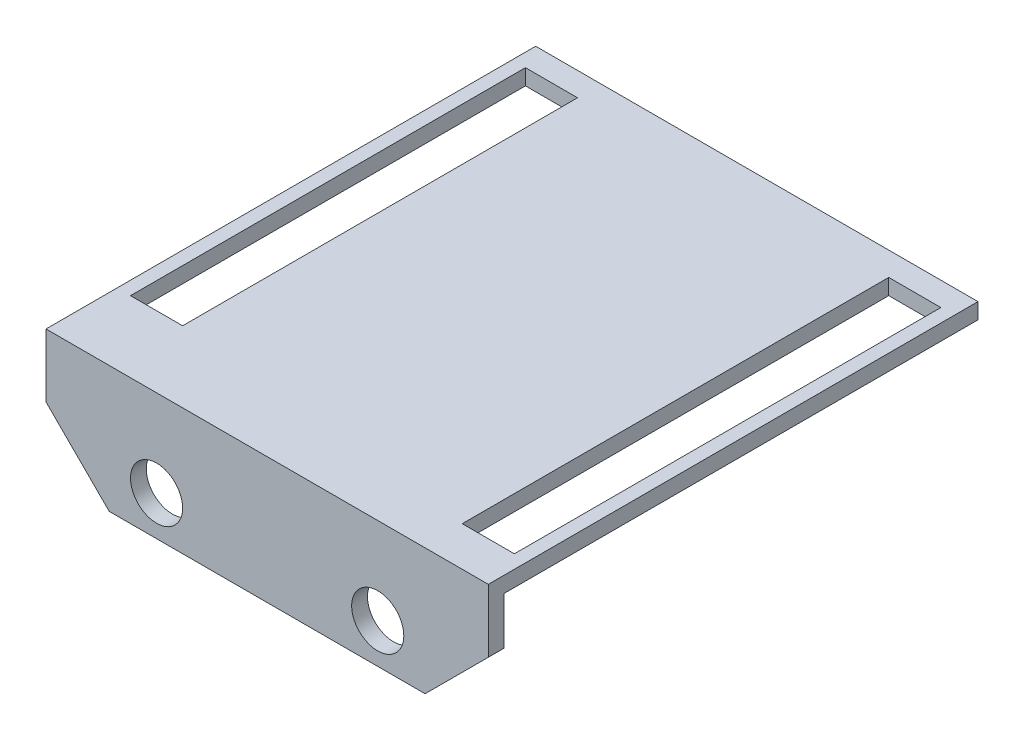
ISO-10303-21;
HEADER;
FILE_DESCRIPTION(('STEP AP214'),'2;1');
FILE_NAME('part.step','',(''),(''),'','','');
FILE_SCHEMA(('AUTOMOTIVE_DESIGN { 1 0 10303 214 1 1 1 1 }'));
ENDSEC;
DATA;
#1=APPLICATION_CONTEXT('core data for automotive mechanical design processes');
#2=APPLICATION_PROTOCOL_DEFINITION('international standard','automotive_design',2000,#1);
#3=PRODUCT_CONTEXT('',#1,'mechanical');
#4=PRODUCT('Part','Part','',(#3));
#5=PRODUCT_RELATED_PRODUCT_CATEGORY('part','',(#4));
#6=PRODUCT_DEFINITION_FORMATION('','',#4);
#7=PRODUCT_DEFINITION_CONTEXT('part definition',#1,'design');
#8=PRODUCT_DEFINITION('design','',#6,#7);
#9=PRODUCT_DEFINITION_SHAPE('','',#8);
#10=(LENGTH_UNIT() NAMED_UNIT(*) SI_UNIT(.MILLI.,.METRE.));
#11=(NAMED_UNIT(*) PLANE_ANGLE_UNIT() SI_UNIT($,.RADIAN.));
#12=(NAMED_UNIT(*) SI_UNIT($,.STERADIAN.) SOLID_ANGLE_UNIT());
#13=UNCERTAINTY_MEASURE_WITH_UNIT(LENGTH_MEASURE(1.E-05),#10,'distance_accuracy_value','');
#14=(GEOMETRIC_REPRESENTATION_CONTEXT(3) GLOBAL_UNCERTAINTY_ASSIGNED_CONTEXT((#13)) GLOBAL_UNIT_ASSIGNED_CONTEXT((#10,
#11,#12)) REPRESENTATION_CONTEXT('',''));
#15=CARTESIAN_POINT('',(0.,0.,0.));
#16=DIRECTION('',(0.,0.,1.));
#17=DIRECTION('',(1.,0.,0.));
#18=AXIS2_PLACEMENT_3D('',#15,#16,#17);
#19=CARTESIAN_POINT('',(14.,-4.,1.));
#20=DIRECTION('',(-1.,0.,0.));
#21=DIRECTION('',(0.,0.,1.));
#22=AXIS2_PLACEMENT_3D('',#19,#20,#21);
#23=PLANE('',#22);
#24=DIRECTION('',(0.,1.,0.));
#25=VECTOR('',#24,1.);
#26=CARTESIAN_POINT('',(14.,-4.,1.));
#27=LINE('',#26,#25);
#28=CARTESIAN_POINT('',(14.,0.,1.));
#29=VERTEX_POINT('',#28);
#30=CARTESIAN_POINT('',(14.,4.,1.));
#31=VERTEX_POINT('',#30);
#32=EDGE_CURVE('E229',#29,#31,#27,.T.);
#33=ORIENTED_EDGE('',*,*,#32,.F.);
#34=DIRECTION('',(0.,0.,-1.));
#35=VECTOR('',#34,1.);
#36=CARTESIAN_POINT('',(14.,0.,1.));
#37=LINE('',#36,#35);
#38=CARTESIAN_POINT('',(14.,0.,0.));
#39=VERTEX_POINT('',#38);
#40=EDGE_CURVE('E265',#29,#39,#37,.T.);
#41=ORIENTED_EDGE('',*,*,#40,.T.);
#42=DIRECTION('',(0.,1.,0.));
#43=VECTOR('',#42,1.);
#44=CARTESIAN_POINT('',(14.,-4.,0.));
#45=LINE('',#44,#43);
#46=CARTESIAN_POINT('',(14.,3.,0.));
#47=VERTEX_POINT('',#46);
#48=EDGE_CURVE('E228',#39,#47,#45,.T.);
#49=ORIENTED_EDGE('',*,*,#48,.T.);
#50=DIRECTION('',(0.,0.,1.));
#51=VECTOR('',#50,1.);
#52=CARTESIAN_POINT('',(14.,3.,-30.));
#53=LINE('',#52,#51);
#54=CARTESIAN_POINT('',(14.,3.,-30.));
#55=VERTEX_POINT('',#54);
#56=EDGE_CURVE('E225',#55,#47,#53,.T.);
#57=ORIENTED_EDGE('',*,*,#56,.F.);
#58=DIRECTION('',(0.,-1.,0.));
#59=VECTOR('',#58,1.);
#60=CARTESIAN_POINT('',(14.,4.,-30.));
#61=LINE('',#60,#59);
#62=CARTESIAN_POINT('',(14.,4.,-30.));
#63=VERTEX_POINT('',#62);
#64=EDGE_CURVE('E209',#63,#55,#61,.T.);
#65=ORIENTED_EDGE('',*,*,#64,.F.);
#66=DIRECTION('',(0.,0.,-1.));
#67=VECTOR('',#66,1.);
#68=CARTESIAN_POINT('',(14.,4.,1.));
#69=LINE('',#68,#67);
#70=EDGE_CURVE('E248',#31,#63,#69,.T.);
#71=ORIENTED_EDGE('',*,*,#70,.F.);
#72=EDGE_LOOP('',(#33,#41,#49,#57,#65,#71));
#73=FACE_BOUND('',#72,.T.);
#74=ADVANCED_FACE('F32',(#73),#23,.F.);
#75=CARTESIAN_POINT('',(-14.,4.,1.));
#76=DIRECTION('',(0.,-1.,0.));
#77=DIRECTION('',(0.,0.,-1.));
#78=AXIS2_PLACEMENT_3D('',#75,#76,#77);
#79=PLANE('',#78);
#80=DIRECTION('',(-1.,0.,0.));
#81=VECTOR('',#80,1.);
#82=CARTESIAN_POINT('',(13.15,4.,-28.5));
#83=LINE('',#82,#81);
#84=CARTESIAN_POINT('',(13.15,4.,-28.5));
#85=VERTEX_POINT('',#84);
#86=CARTESIAN_POINT('',(9.85,4.,-28.5));
#87=VERTEX_POINT('',#86);
#88=EDGE_CURVE('E162',#85,#87,#83,.T.);
#89=ORIENTED_EDGE('',*,*,#88,.F.);
#90=DIRECTION('',(0.,0.,-1.));
#91=VECTOR('',#90,1.);
#92=CARTESIAN_POINT('',(13.15,4.,-28.5));
#93=LINE('',#92,#91);
#94=CARTESIAN_POINT('',(13.15,4.,-1.5));
#95=VERTEX_POINT('',#94);
#96=EDGE_CURVE('E47',#95,#85,#93,.T.);
#97=ORIENTED_EDGE('',*,*,#96,.F.);
#98=DIRECTION('',(1.,0.,0.));
#99=VECTOR('',#98,1.);
#100=CARTESIAN_POINT('',(13.15,4.,-1.5));
#101=LINE('',#100,#99);
#102=CARTESIAN_POINT('',(9.85,4.,-1.5));
#103=VERTEX_POINT('',#102);
#104=EDGE_CURVE('E169',#103,#95,#101,.T.);
#105=ORIENTED_EDGE('',*,*,#104,.F.);
#106=DIRECTION('',(0.,0.,1.));
#107=VECTOR('',#106,1.);
#108=CARTESIAN_POINT('',(9.85,4.,-28.5));
#109=LINE('',#108,#107);
#110=EDGE_CURVE('E152',#87,#103,#109,.T.);
#111=ORIENTED_EDGE('',*,*,#110,.F.);
#112=EDGE_LOOP('',(#89,#97,#105,#111));
#113=FACE_BOUND('',#112,.T.);
#114=DIRECTION('',(1.,0.,0.));
#115=VECTOR('',#114,1.);
#116=CARTESIAN_POINT('',(-13.15,4.,-3.5));
#117=LINE('',#116,#115);
#118=CARTESIAN_POINT('',(-13.15,4.,-3.5));
#119=VERTEX_POINT('',#118);
#120=CARTESIAN_POINT('',(-9.85,4.,-3.5));
#121=VERTEX_POINT('',#120);
#122=EDGE_CURVE('E180',#119,#121,#117,.T.);
#123=ORIENTED_EDGE('',*,*,#122,.F.);
#124=DIRECTION('',(0.,0.,1.));
#125=VECTOR('',#124,1.);
#126=CARTESIAN_POINT('',(-13.15,4.,-28.5));
#127=LINE('',#126,#125);
#128=CARTESIAN_POINT('',(-13.15,4.,-28.5));
#129=VERTEX_POINT('',#128);
#130=EDGE_CURVE('E55',#129,#119,#127,.T.);
#131=ORIENTED_EDGE('',*,*,#130,.F.);
#132=DIRECTION('',(-1.,0.,0.));
#133=VECTOR('',#132,1.);
#134=CARTESIAN_POINT('',(-13.15,4.,-28.5));
#135=LINE('',#134,#133);
#136=CARTESIAN_POINT('',(-9.85,4.,-28.5));
#137=VERTEX_POINT('',#136);
#138=EDGE_CURVE('E186',#137,#129,#135,.T.);
#139=ORIENTED_EDGE('',*,*,#138,.F.);
#140=DIRECTION('',(0.,0.,-1.));
#141=VECTOR('',#140,1.);
#142=CARTESIAN_POINT('',(-9.85,4.,-28.5));
#143=LINE('',#142,#141);
#144=EDGE_CURVE('E183',#121,#137,#143,.T.);
#145=ORIENTED_EDGE('',*,*,#144,.F.);
#146=EDGE_LOOP('',(#123,#131,#139,#145));
#147=FACE_BOUND('',#146,.T.);
#148=ORIENTED_EDGE('',*,*,#70,.T.);
#149=DIRECTION('',(1.,0.,0.));
#150=VECTOR('',#149,1.);
#151=CARTESIAN_POINT('',(14.,4.,-30.));
#152=LINE('',#151,#150);
#153=CARTESIAN_POINT('',(-14.,4.,-30.));
#154=VERTEX_POINT('',#153);
#155=EDGE_CURVE('E217',#154,#63,#152,.T.);
#156=ORIENTED_EDGE('',*,*,#155,.F.);
#157=DIRECTION('',(0.,0.,-1.));
#158=VECTOR('',#157,1.);
#159=CARTESIAN_POINT('',(-14.,4.,1.));
#160=LINE('',#159,#158);
#161=CARTESIAN_POINT('',(-14.,4.,1.));
#162=VERTEX_POINT('',#161);
#163=EDGE_CURVE('E240',#162,#154,#160,.T.);
#164=ORIENTED_EDGE('',*,*,#163,.F.);
#165=DIRECTION('',(-1.,0.,0.));
#166=VECTOR('',#165,1.);
#167=CARTESIAN_POINT('',(-14.,4.,1.));
#168=LINE('',#167,#166);
#169=EDGE_CURVE('E231',#31,#162,#168,.T.);
#170=ORIENTED_EDGE('',*,*,#169,.F.);
#171=EDGE_LOOP('',(#148,#156,#164,#170));
#172=FACE_BOUND('',#171,.T.);
#173=ADVANCED_FACE('F166',(#113,#147,#172),#79,.F.);
#174=CARTESIAN_POINT('',(-14.,-4.,1.));
#175=DIRECTION('',(1.,0.,0.));
#176=DIRECTION('',(0.,0.,-1.));
#177=AXIS2_PLACEMENT_3D('',#174,#175,#176);
#178=PLANE('',#177);
#179=DIRECTION('',(0.,-1.,0.));
#180=VECTOR('',#179,1.);
#181=CARTESIAN_POINT('',(-14.,-4.,0.));
#182=LINE('',#181,#180);
#183=CARTESIAN_POINT('',(-14.,3.,0.));
#184=VERTEX_POINT('',#183);
#185=CARTESIAN_POINT('',(-14.,0.,0.));
#186=VERTEX_POINT('',#185);
#187=EDGE_CURVE('E242',#184,#186,#182,.T.);
#188=ORIENTED_EDGE('',*,*,#187,.T.);
#189=DIRECTION('',(0.,0.,1.));
#190=VECTOR('',#189,1.);
#191=CARTESIAN_POINT('',(-14.,0.,1.));
#192=LINE('',#191,#190);
#193=CARTESIAN_POINT('',(-14.,0.,1.));
#194=VERTEX_POINT('',#193);
#195=EDGE_CURVE('E259',#186,#194,#192,.T.);
#196=ORIENTED_EDGE('',*,*,#195,.T.);
#197=DIRECTION('',(0.,-1.,0.));
#198=VECTOR('',#197,1.);
#199=CARTESIAN_POINT('',(-14.,-4.,1.));
#200=LINE('',#199,#198);
#201=EDGE_CURVE('E234',#162,#194,#200,.T.);
#202=ORIENTED_EDGE('',*,*,#201,.F.);
#203=ORIENTED_EDGE('',*,*,#163,.T.);
#204=DIRECTION('',(0.,1.,0.));
#205=VECTOR('',#204,1.);
#206=CARTESIAN_POINT('',(-14.,4.,-30.));
#207=LINE('',#206,#205);
#208=CARTESIAN_POINT('',(-14.,3.,-30.));
#209=VERTEX_POINT('',#208);
#210=EDGE_CURVE('E214',#209,#154,#207,.T.);
#211=ORIENTED_EDGE('',*,*,#210,.F.);
#212=DIRECTION('',(0.,0.,1.));
#213=VECTOR('',#212,1.);
#214=CARTESIAN_POINT('',(-14.,3.,-30.));
#215=LINE('',#214,#213);
#216=EDGE_CURVE('E220',#209,#184,#215,.T.);
#217=ORIENTED_EDGE('',*,*,#216,.T.);
#218=EDGE_LOOP('',(#188,#196,#202,#203,#211,#217));
#219=FACE_BOUND('',#218,.T.);
#220=ADVANCED_FACE('F309',(#219),#178,.F.);
#221=CARTESIAN_POINT('',(-14.,-4.,1.));
#222=DIRECTION('',(0.,1.,0.));
#223=DIRECTION('',(0.,0.,1.));
#224=AXIS2_PLACEMENT_3D('',#221,#222,#223);
#225=PLANE('',#224);
#226=DIRECTION('',(1.,0.,0.));
#227=VECTOR('',#226,1.);
#228=CARTESIAN_POINT('',(-14.,-4.,1.));
#229=LINE('',#228,#227);
#230=CARTESIAN_POINT('',(-10.,-4.,1.));
#231=VERTEX_POINT('',#230);
#232=CARTESIAN_POINT('',(9.99999999999999,-4.,1.));
#233=VERTEX_POINT('',#232);
#234=EDGE_CURVE('E237',#231,#233,#229,.T.);
#235=ORIENTED_EDGE('',*,*,#234,.F.);
#236=DIRECTION('',(0.,0.,-1.));
#237=VECTOR('',#236,1.);
#238=CARTESIAN_POINT('',(-10.,-4.,1.));
#239=LINE('',#238,#237);
#240=CARTESIAN_POINT('',(-10.,-4.,0.));
#241=VERTEX_POINT('',#240);
#242=EDGE_CURVE('E252',#231,#241,#239,.T.);
#243=ORIENTED_EDGE('',*,*,#242,.T.);
#244=DIRECTION('',(1.,0.,0.));
#245=VECTOR('',#244,1.);
#246=CARTESIAN_POINT('',(-14.,-4.,0.));
#247=LINE('',#246,#245);
#248=CARTESIAN_POINT('',(9.99999999999999,-4.,0.));
#249=VERTEX_POINT('',#248);
#250=EDGE_CURVE('E232',#241,#249,#247,.T.);
#251=ORIENTED_EDGE('',*,*,#250,.T.);
#252=DIRECTION('',(0.,0.,1.));
#253=VECTOR('',#252,1.);
#254=CARTESIAN_POINT('',(9.99999999999999,-4.,1.));
#255=LINE('',#254,#253);
#256=EDGE_CURVE('E250',#249,#233,#255,.T.);
#257=ORIENTED_EDGE('',*,*,#256,.T.);
#258=EDGE_LOOP('',(#235,#243,#251,#257));
#259=FACE_BOUND('',#258,.T.);
#260=ADVANCED_FACE('F335',(#259),#225,.F.);
#261=CARTESIAN_POINT('',(0.,0.,1.));
#262=DIRECTION('',(0.,0.,-1.));
#263=DIRECTION('',(-1.,0.,0.));
#264=AXIS2_PLACEMENT_3D('',#261,#262,#263);
#265=PLANE('',#264);
#266=CARTESIAN_POINT('',(-7.,-1.5,1.));
#267=DIRECTION('',(0.,0.,1.));
#268=DIRECTION('',(1.,0.,0.));
#269=AXIS2_PLACEMENT_3D('',#266,#267,#268);
#270=CIRCLE('',#269,1.65);
#271=CARTESIAN_POINT('',(-5.35,-1.5,1.));
#272=VERTEX_POINT('',#271);
#273=EDGE_CURVE('E201',#272,#272,#270,.T.);
#274=ORIENTED_EDGE('',*,*,#273,.F.);
#275=EDGE_LOOP('',(#274));
#276=FACE_BOUND('',#275,.T.);
#277=CARTESIAN_POINT('',(7.,-1.5,1.));
#278=DIRECTION('',(0.,0.,1.));
#279=DIRECTION('',(1.,0.,0.));
#280=AXIS2_PLACEMENT_3D('',#277,#278,#279);
#281=CIRCLE('',#280,1.65);
#282=CARTESIAN_POINT('',(8.65,-1.5,1.));
#283=VERTEX_POINT('',#282);
#284=EDGE_CURVE('E176',#283,#283,#281,.T.);
#285=ORIENTED_EDGE('',*,*,#284,.F.);
#286=EDGE_LOOP('',(#285));
#287=FACE_BOUND('',#286,.T.);
#288=ORIENTED_EDGE('',*,*,#201,.T.);
#289=DIRECTION('',(-0.707106781186546,0.707106781186549,0.));
#290=VECTOR('',#289,1.);
#291=CARTESIAN_POINT('',(-10.,-4.,1.));
#292=LINE('',#291,#290);
#293=EDGE_CURVE('E263',#194,#231,#292,.F.);
#294=ORIENTED_EDGE('',*,*,#293,.T.);
#295=ORIENTED_EDGE('',*,*,#234,.T.);
#296=DIRECTION('',(-0.707106781186549,-0.707106781186546,0.));
#297=VECTOR('',#296,1.);
#298=CARTESIAN_POINT('',(14.,0.,1.));
#299=LINE('',#298,#297);
#300=EDGE_CURVE('E261',#233,#29,#299,.F.);
#301=ORIENTED_EDGE('',*,*,#300,.T.);
#302=ORIENTED_EDGE('',*,*,#32,.T.);
#303=ORIENTED_EDGE('',*,*,#169,.T.);
#304=EDGE_LOOP('',(#288,#294,#295,#301,#302,#303));
#305=FACE_BOUND('',#304,.T.);
#306=ADVANCED_FACE('F331',(#276,#287,#305),#265,.F.);
#307=CARTESIAN_POINT('',(0.,0.,0.));
#308=DIRECTION('',(0.,0.,-1.));
#309=DIRECTION('',(-1.,0.,0.));
#310=AXIS2_PLACEMENT_3D('',#307,#308,#309);
#311=PLANE('',#310);
#312=CARTESIAN_POINT('',(-7.,-1.5,0.));
#313=DIRECTION('',(0.,0.,1.));
#314=DIRECTION('',(1.,0.,0.));
#315=AXIS2_PLACEMENT_3D('',#312,#313,#314);
#316=CIRCLE('',#315,1.65);
#317=CARTESIAN_POINT('',(-5.35,-1.5,0.));
#318=VERTEX_POINT('',#317);
#319=EDGE_CURVE('E197',#318,#318,#316,.T.);
#320=ORIENTED_EDGE('',*,*,#319,.T.);
#321=EDGE_LOOP('',(#320));
#322=FACE_BOUND('',#321,.T.);
#323=CARTESIAN_POINT('',(7.,-1.5,0.));
#324=DIRECTION('',(0.,0.,1.));
#325=DIRECTION('',(1.,0.,0.));
#326=AXIS2_PLACEMENT_3D('',#323,#324,#325);
#327=CIRCLE('',#326,1.65);
#328=CARTESIAN_POINT('',(8.65,-1.5,0.));
#329=VERTEX_POINT('',#328);
#330=EDGE_CURVE('E204',#329,#329,#327,.T.);
#331=ORIENTED_EDGE('',*,*,#330,.T.);
#332=EDGE_LOOP('',(#331));
#333=FACE_BOUND('',#332,.T.);
#334=ORIENTED_EDGE('',*,*,#250,.F.);
#335=DIRECTION('',(0.707106781186546,-0.707106781186549,0.));
#336=VECTOR('',#335,1.);
#337=CARTESIAN_POINT('',(-7.00000000000002,-7.,0.));
#338=LINE('',#337,#336);
#339=EDGE_CURVE('E257',#241,#186,#338,.F.);
#340=ORIENTED_EDGE('',*,*,#339,.T.);
#341=ORIENTED_EDGE('',*,*,#187,.F.);
#342=DIRECTION('',(-1.,0.,0.));
#343=VECTOR('',#342,1.);
#344=CARTESIAN_POINT('',(14.,3.,0.));
#345=LINE('',#344,#343);
#346=EDGE_CURVE('E200',#47,#184,#345,.T.);
#347=ORIENTED_EDGE('',*,*,#346,.F.);
#348=ORIENTED_EDGE('',*,*,#48,.F.);
#349=DIRECTION('',(0.707106781186549,0.707106781186546,0.));
#350=VECTOR('',#349,1.);
#351=CARTESIAN_POINT('',(6.99999999999998,-7.,0.));
#352=LINE('',#351,#350);
#353=EDGE_CURVE('E255',#39,#249,#352,.F.);
#354=ORIENTED_EDGE('',*,*,#353,.T.);
#355=EDGE_LOOP('',(#334,#340,#341,#347,#348,#354));
#356=FACE_BOUND('',#355,.T.);
#357=ADVANCED_FACE('F354',(#322,#333,#356),#311,.T.);
#358=CARTESIAN_POINT('',(14.,3.,-30.));
#359=DIRECTION('',(0.,1.,0.));
#360=DIRECTION('',(0.,0.,1.));
#361=AXIS2_PLACEMENT_3D('',#358,#359,#360);
#362=PLANE('',#361);
#363=DIRECTION('',(1.,0.,0.));
#364=VECTOR('',#363,1.);
#365=CARTESIAN_POINT('',(14.,3.,-1.5));
#366=LINE('',#365,#364);
#367=CARTESIAN_POINT('',(9.85,3.,-1.5));
#368=VERTEX_POINT('',#367);
#369=CARTESIAN_POINT('',(13.15,3.,-1.5));
#370=VERTEX_POINT('',#369);
#371=EDGE_CURVE('E40',#368,#370,#366,.T.);
#372=ORIENTED_EDGE('',*,*,#371,.T.);
#373=DIRECTION('',(0.,0.,-1.));
#374=VECTOR('',#373,1.);
#375=CARTESIAN_POINT('',(13.15,3.,-30.));
#376=LINE('',#375,#374);
#377=CARTESIAN_POINT('',(13.15,3.,-28.5));
#378=VERTEX_POINT('',#377);
#379=EDGE_CURVE('E11',#370,#378,#376,.T.);
#380=ORIENTED_EDGE('',*,*,#379,.T.);
#381=DIRECTION('',(-1.,0.,0.));
#382=VECTOR('',#381,1.);
#383=CARTESIAN_POINT('',(14.,3.,-28.5));
#384=LINE('',#383,#382);
#385=CARTESIAN_POINT('',(9.85,3.,-28.5));
#386=VERTEX_POINT('',#385);
#387=EDGE_CURVE('E280',#378,#386,#384,.T.);
#388=ORIENTED_EDGE('',*,*,#387,.T.);
#389=DIRECTION('',(0.,0.,1.));
#390=VECTOR('',#389,1.);
#391=CARTESIAN_POINT('',(9.85,3.,-30.));
#392=LINE('',#391,#390);
#393=EDGE_CURVE('E155',#386,#368,#392,.T.);
#394=ORIENTED_EDGE('',*,*,#393,.T.);
#395=EDGE_LOOP('',(#372,#380,#388,#394));
#396=FACE_BOUND('',#395,.T.);
#397=DIRECTION('',(-1.,0.,0.));
#398=VECTOR('',#397,1.);
#399=CARTESIAN_POINT('',(14.,3.,-28.5));
#400=LINE('',#399,#398);
#401=CARTESIAN_POINT('',(-9.85,3.,-28.5));
#402=VERTEX_POINT('',#401);
#403=CARTESIAN_POINT('',(-13.15,3.,-28.5));
#404=VERTEX_POINT('',#403);
#405=EDGE_CURVE('E274',#402,#404,#400,.T.);
#406=ORIENTED_EDGE('',*,*,#405,.T.);
#407=DIRECTION('',(0.,0.,1.));
#408=VECTOR('',#407,1.);
#409=CARTESIAN_POINT('',(-13.15,3.,-30.));
#410=LINE('',#409,#408);
#411=CARTESIAN_POINT('',(-13.15,3.,-3.5));
#412=VERTEX_POINT('',#411);
#413=EDGE_CURVE('E277',#404,#412,#410,.T.);
#414=ORIENTED_EDGE('',*,*,#413,.T.);
#415=DIRECTION('',(1.,0.,0.));
#416=VECTOR('',#415,1.);
#417=CARTESIAN_POINT('',(14.,3.,-3.5));
#418=LINE('',#417,#416);
#419=CARTESIAN_POINT('',(-9.85,3.,-3.5));
#420=VERTEX_POINT('',#419);
#421=EDGE_CURVE('E268',#412,#420,#418,.T.);
#422=ORIENTED_EDGE('',*,*,#421,.T.);
#423=DIRECTION('',(0.,0.,-1.));
#424=VECTOR('',#423,1.);
#425=CARTESIAN_POINT('',(-9.85,3.,-30.));
#426=LINE('',#425,#424);
#427=EDGE_CURVE('E271',#420,#402,#426,.T.);
#428=ORIENTED_EDGE('',*,*,#427,.T.);
#429=EDGE_LOOP('',(#406,#414,#422,#428));
#430=FACE_BOUND('',#429,.T.);
#431=ORIENTED_EDGE('',*,*,#346,.T.);
#432=ORIENTED_EDGE('',*,*,#216,.F.);
#433=DIRECTION('',(-1.,0.,0.));
#434=VECTOR('',#433,1.);
#435=CARTESIAN_POINT('',(14.,3.,-30.));
#436=LINE('',#435,#434);
#437=EDGE_CURVE('E212',#55,#209,#436,.T.);
#438=ORIENTED_EDGE('',*,*,#437,.F.);
#439=ORIENTED_EDGE('',*,*,#56,.T.);
#440=EDGE_LOOP('',(#431,#432,#438,#439));
#441=FACE_BOUND('',#440,.T.);
#442=ADVANCED_FACE('F284',(#396,#430,#441),#362,.F.);
#443=CARTESIAN_POINT('',(0.,0.,-30.));
#444=DIRECTION('',(0.,0.,-1.));
#445=DIRECTION('',(-1.,0.,0.));
#446=AXIS2_PLACEMENT_3D('',#443,#444,#445);
#447=PLANE('',#446);
#448=ORIENTED_EDGE('',*,*,#64,.T.);
#449=ORIENTED_EDGE('',*,*,#437,.T.);
#450=ORIENTED_EDGE('',*,*,#210,.T.);
#451=ORIENTED_EDGE('',*,*,#155,.T.);
#452=EDGE_LOOP('',(#448,#449,#450,#451));
#453=FACE_BOUND('',#452,.T.);
#454=ADVANCED_FACE('F348',(#453),#447,.T.);
#455=CARTESIAN_POINT('',(7.,-1.5,0.));
#456=DIRECTION('',(0.,0.,1.));
#457=DIRECTION('',(1.,0.,0.));
#458=AXIS2_PLACEMENT_3D('',#455,#456,#457);
#459=CYLINDRICAL_SURFACE('',#458,1.65);
#460=ORIENTED_EDGE('',*,*,#330,.F.);
#461=EDGE_LOOP('',(#460));
#462=FACE_BOUND('',#461,.T.);
#463=ORIENTED_EDGE('',*,*,#284,.T.);
#464=EDGE_LOOP('',(#463));
#465=FACE_BOUND('',#464,.T.);
#466=ADVANCED_FACE('F323',(#462,#465),#459,.F.);
#467=CARTESIAN_POINT('',(-7.,-1.5,0.));
#468=DIRECTION('',(0.,0.,1.));
#469=DIRECTION('',(1.,0.,0.));
#470=AXIS2_PLACEMENT_3D('',#467,#468,#469);
#471=CYLINDRICAL_SURFACE('',#470,1.65);
#472=ORIENTED_EDGE('',*,*,#319,.F.);
#473=EDGE_LOOP('',(#472));
#474=FACE_BOUND('',#473,.T.);
#475=ORIENTED_EDGE('',*,*,#273,.T.);
#476=EDGE_LOOP('',(#475));
#477=FACE_BOUND('',#476,.T.);
#478=ADVANCED_FACE('F315',(#474,#477),#471,.F.);
#479=CARTESIAN_POINT('',(-10.,-4.,1.));
#480=DIRECTION('',(0.707106781186549,0.707106781186546,0.));
#481=DIRECTION('',(0.,0.,-1.));
#482=AXIS2_PLACEMENT_3D('',#479,#480,#481);
#483=PLANE('',#482);
#484=ORIENTED_EDGE('',*,*,#293,.F.);
#485=ORIENTED_EDGE('',*,*,#195,.F.);
#486=ORIENTED_EDGE('',*,*,#339,.F.);
#487=ORIENTED_EDGE('',*,*,#242,.F.);
#488=EDGE_LOOP('',(#484,#485,#486,#487));
#489=FACE_BOUND('',#488,.T.);
#490=ADVANCED_FACE('F313',(#489),#483,.F.);
#491=CARTESIAN_POINT('',(14.,0.,1.));
#492=DIRECTION('',(-0.707106781186546,0.707106781186549,0.));
#493=DIRECTION('',(0.,0.,-1.));
#494=AXIS2_PLACEMENT_3D('',#491,#492,#493);
#495=PLANE('',#494);
#496=ORIENTED_EDGE('',*,*,#300,.F.);
#497=ORIENTED_EDGE('',*,*,#256,.F.);
#498=ORIENTED_EDGE('',*,*,#353,.F.);
#499=ORIENTED_EDGE('',*,*,#40,.F.);
#500=EDGE_LOOP('',(#496,#497,#498,#499));
#501=FACE_BOUND('',#500,.T.);
#502=ADVANCED_FACE('F34',(#501),#495,.F.);
#503=CARTESIAN_POINT('',(-13.15,-6.,-28.5));
#504=DIRECTION('',(-1.,0.,0.));
#505=DIRECTION('',(0.,0.,1.));
#506=AXIS2_PLACEMENT_3D('',#503,#504,#505);
#507=PLANE('',#506);
#508=DIRECTION('',(0.,1.,0.));
#509=VECTOR('',#508,1.);
#510=CARTESIAN_POINT('',(-13.15,-6.,-28.5));
#511=LINE('',#510,#509);
#512=EDGE_CURVE('E190',#404,#129,#511,.T.);
#513=ORIENTED_EDGE('',*,*,#512,.T.);
#514=ORIENTED_EDGE('',*,*,#130,.T.);
#515=DIRECTION('',(0.,1.,0.));
#516=VECTOR('',#515,1.);
#517=CARTESIAN_POINT('',(-13.15,-6.,-3.5));
#518=LINE('',#517,#516);
#519=EDGE_CURVE('E189',#412,#119,#518,.T.);
#520=ORIENTED_EDGE('',*,*,#519,.F.);
#521=ORIENTED_EDGE('',*,*,#413,.F.);
#522=EDGE_LOOP('',(#513,#514,#520,#521));
#523=FACE_BOUND('',#522,.T.);
#524=ADVANCED_FACE('F321',(#523),#507,.F.);
#525=CARTESIAN_POINT('',(-13.15,-6.,-28.5));
#526=DIRECTION('',(0.,0.,-1.));
#527=DIRECTION('',(-1.,0.,0.));
#528=AXIS2_PLACEMENT_3D('',#525,#526,#527);
#529=PLANE('',#528);
#530=DIRECTION('',(0.,1.,0.));
#531=VECTOR('',#530,1.);
#532=CARTESIAN_POINT('',(-9.85,-6.,-28.5));
#533=LINE('',#532,#531);
#534=EDGE_CURVE('E192',#402,#137,#533,.T.);
#535=ORIENTED_EDGE('',*,*,#534,.T.);
#536=ORIENTED_EDGE('',*,*,#138,.T.);
#537=ORIENTED_EDGE('',*,*,#512,.F.);
#538=ORIENTED_EDGE('',*,*,#405,.F.);
#539=EDGE_LOOP('',(#535,#536,#537,#538));
#540=FACE_BOUND('',#539,.T.);
#541=ADVANCED_FACE('F419',(#540),#529,.F.);
#542=CARTESIAN_POINT('',(-9.85,-6.,-28.5));
#543=DIRECTION('',(1.,0.,0.));
#544=DIRECTION('',(0.,0.,-1.));
#545=AXIS2_PLACEMENT_3D('',#542,#543,#544);
#546=PLANE('',#545);
#547=DIRECTION('',(0.,1.,0.));
#548=VECTOR('',#547,1.);
#549=CARTESIAN_POINT('',(-9.85,-6.,-3.5));
#550=LINE('',#549,#548);
#551=EDGE_CURVE('E194',#420,#121,#550,.T.);
#552=ORIENTED_EDGE('',*,*,#551,.T.);
#553=ORIENTED_EDGE('',*,*,#144,.T.);
#554=ORIENTED_EDGE('',*,*,#534,.F.);
#555=ORIENTED_EDGE('',*,*,#427,.F.);
#556=EDGE_LOOP('',(#552,#553,#554,#555));
#557=FACE_BOUND('',#556,.T.);
#558=ADVANCED_FACE('F298',(#557),#546,.F.);
#559=CARTESIAN_POINT('',(-13.15,-6.,-3.5));
#560=DIRECTION('',(0.,0.,1.));
#561=DIRECTION('',(1.,0.,0.));
#562=AXIS2_PLACEMENT_3D('',#559,#560,#561);
#563=PLANE('',#562);
#564=ORIENTED_EDGE('',*,*,#519,.T.);
#565=ORIENTED_EDGE('',*,*,#122,.T.);
#566=ORIENTED_EDGE('',*,*,#551,.F.);
#567=ORIENTED_EDGE('',*,*,#421,.F.);
#568=EDGE_LOOP('',(#564,#565,#566,#567));
#569=FACE_BOUND('',#568,.T.);
#570=ADVANCED_FACE('F291',(#569),#563,.F.);
#571=CARTESIAN_POINT('',(13.15,-6.,-28.5));
#572=DIRECTION('',(1.,0.,0.));
#573=DIRECTION('',(0.,0.,-1.));
#574=AXIS2_PLACEMENT_3D('',#571,#572,#573);
#575=PLANE('',#574);
#576=DIRECTION('',(0.,1.,0.));
#577=VECTOR('',#576,1.);
#578=CARTESIAN_POINT('',(13.15,-6.,-1.5));
#579=LINE('',#578,#577);
#580=EDGE_CURVE('E174',#370,#95,#579,.T.);
#581=ORIENTED_EDGE('',*,*,#580,.T.);
#582=ORIENTED_EDGE('',*,*,#96,.T.);
#583=DIRECTION('',(0.,1.,0.));
#584=VECTOR('',#583,1.);
#585=CARTESIAN_POINT('',(13.15,-6.,-28.5));
#586=LINE('',#585,#584);
#587=EDGE_CURVE('E159',#378,#85,#586,.T.);
#588=ORIENTED_EDGE('',*,*,#587,.F.);
#589=ORIENTED_EDGE('',*,*,#379,.F.);
#590=EDGE_LOOP('',(#581,#582,#588,#589));
#591=FACE_BOUND('',#590,.T.);
#592=ADVANCED_FACE('F289',(#591),#575,.F.);
#593=CARTESIAN_POINT('',(13.15,-6.,-1.5));
#594=DIRECTION('',(0.,0.,1.));
#595=DIRECTION('',(1.,0.,0.));
#596=AXIS2_PLACEMENT_3D('',#593,#594,#595);
#597=PLANE('',#596);
#598=DIRECTION('',(0.,1.,0.));
#599=VECTOR('',#598,1.);
#600=CARTESIAN_POINT('',(9.85,-6.,-1.5));
#601=LINE('',#600,#599);
#602=EDGE_CURVE('E158',#368,#103,#601,.T.);
#603=ORIENTED_EDGE('',*,*,#602,.T.);
#604=ORIENTED_EDGE('',*,*,#104,.T.);
#605=ORIENTED_EDGE('',*,*,#580,.F.);
#606=ORIENTED_EDGE('',*,*,#371,.F.);
#607=EDGE_LOOP('',(#603,#604,#605,#606));
#608=FACE_BOUND('',#607,.T.);
#609=ADVANCED_FACE('F288',(#608),#597,.F.);
#610=CARTESIAN_POINT('',(9.85,-6.,-28.5));
#611=DIRECTION('',(-1.,0.,0.));
#612=DIRECTION('',(0.,0.,1.));
#613=AXIS2_PLACEMENT_3D('',#610,#611,#612);
#614=PLANE('',#613);
#615=DIRECTION('',(0.,1.,0.));
#616=VECTOR('',#615,1.);
#617=CARTESIAN_POINT('',(9.85,-6.,-28.5));
#618=LINE('',#617,#616);
#619=EDGE_CURVE('E147',#386,#87,#618,.T.);
#620=ORIENTED_EDGE('',*,*,#619,.T.);
#621=ORIENTED_EDGE('',*,*,#110,.T.);
#622=ORIENTED_EDGE('',*,*,#602,.F.);
#623=ORIENTED_EDGE('',*,*,#393,.F.);
#624=EDGE_LOOP('',(#620,#621,#622,#623));
#625=FACE_BOUND('',#624,.T.);
#626=ADVANCED_FACE('F149',(#625),#614,.F.);
#627=CARTESIAN_POINT('',(13.15,-6.,-28.5));
#628=DIRECTION('',(0.,0.,-1.));
#629=DIRECTION('',(-1.,0.,0.));
#630=AXIS2_PLACEMENT_3D('',#627,#628,#629);
#631=PLANE('',#630);
#632=ORIENTED_EDGE('',*,*,#587,.T.);
#633=ORIENTED_EDGE('',*,*,#88,.T.);
#634=ORIENTED_EDGE('',*,*,#619,.F.);
#635=ORIENTED_EDGE('',*,*,#387,.F.);
#636=EDGE_LOOP('',(#632,#633,#634,#635));
#637=FACE_BOUND('',#636,.T.);
#638=ADVANCED_FACE('F163',(#637),#631,.F.);
#639=CLOSED_SHELL('',(#74,#173,#220,#260,#306,#357,#442,#454,#466,#478,#490,#502,#524,#541,#558,
#570,#592,#609,#626,#638));
#640=MANIFOLD_SOLID_BREP('B2',#639);
#641=ADVANCED_BREP_SHAPE_REPRESENTATION('',(#18,#640),#14);
#642=SHAPE_DEFINITION_REPRESENTATION(#9,#641);
ENDSEC;
END-ISO-10303-21;
